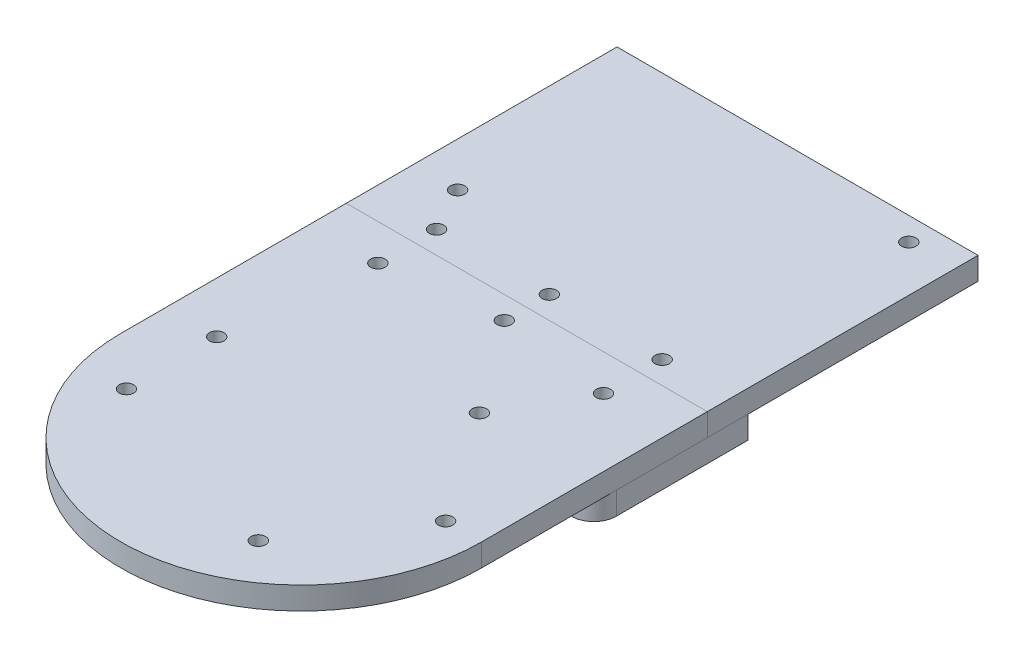
ISO-10303-21;
HEADER;
FILE_DESCRIPTION(('STEP AP214'),'2;1');
FILE_NAME('part.step','',(''),(''),'','','');
FILE_SCHEMA(('AUTOMOTIVE_DESIGN { 1 0 10303 214 1 1 1 1 }'));
ENDSEC;
DATA;
#1=APPLICATION_CONTEXT('core data for automotive mechanical design processes');
#2=APPLICATION_PROTOCOL_DEFINITION('international standard','automotive_design',2000,#1);
#3=PRODUCT_CONTEXT('',#1,'mechanical');
#4=PRODUCT('Part','Part','',(#3));
#5=PRODUCT_RELATED_PRODUCT_CATEGORY('part','',(#4));
#6=PRODUCT_DEFINITION_FORMATION('','',#4);
#7=PRODUCT_DEFINITION_CONTEXT('part definition',#1,'design');
#8=PRODUCT_DEFINITION('design','',#6,#7);
#9=PRODUCT_DEFINITION_SHAPE('','',#8);
#10=(LENGTH_UNIT() NAMED_UNIT(*) SI_UNIT(.MILLI.,.METRE.));
#11=(NAMED_UNIT(*) PLANE_ANGLE_UNIT() SI_UNIT($,.RADIAN.));
#12=(NAMED_UNIT(*) SI_UNIT($,.STERADIAN.) SOLID_ANGLE_UNIT());
#13=UNCERTAINTY_MEASURE_WITH_UNIT(LENGTH_MEASURE(1.E-05),#10,'distance_accuracy_value','');
#14=(GEOMETRIC_REPRESENTATION_CONTEXT(3) GLOBAL_UNCERTAINTY_ASSIGNED_CONTEXT((#13)) GLOBAL_UNIT_ASSIGNED_CONTEXT((#10,
#11,#12)) REPRESENTATION_CONTEXT('',''));
#15=CARTESIAN_POINT('',(0.,0.,0.));
#16=DIRECTION('',(0.,0.,1.));
#17=DIRECTION('',(1.,0.,0.));
#18=AXIS2_PLACEMENT_3D('',#15,#16,#17);
#19=CARTESIAN_POINT('',(0.,-5.,0.));
#20=DIRECTION('',(0.,1.,0.));
#21=DIRECTION('',(0.,0.,1.));
#22=AXIS2_PLACEMENT_3D('',#19,#20,#21);
#23=CYLINDRICAL_SURFACE('',#22,41.);
#24=CARTESIAN_POINT('',(0.,-5.,0.));
#25=DIRECTION('',(0.,1.,0.));
#26=DIRECTION('',(0.,0.,-1.));
#27=AXIS2_PLACEMENT_3D('',#24,#25,#26);
#28=CIRCLE('',#27,41.);
#29=CARTESIAN_POINT('',(31.195652173913,-5.,-26.605098861764));
#30=VERTEX_POINT('',#29);
#31=CARTESIAN_POINT('',(-31.195652173913,-5.,-26.605098861764));
#32=VERTEX_POINT('',#31);
#33=EDGE_CURVE('E118',#30,#32,#28,.T.);
#34=ORIENTED_EDGE('',*,*,#33,.F.);
#35=DIRECTION('',(0.,1.,0.));
#36=VECTOR('',#35,1.);
#37=CARTESIAN_POINT('',(31.195652173913,-5.,-26.605098861764));
#38=LINE('',#37,#36);
#39=CARTESIAN_POINT('',(31.195652173913,0.,-26.605098861764));
#40=VERTEX_POINT('',#39);
#41=EDGE_CURVE('E241',#30,#40,#38,.T.);
#42=ORIENTED_EDGE('',*,*,#41,.T.);
#43=CARTESIAN_POINT('',(0.,0.,0.));
#44=DIRECTION('',(0.,1.,0.));
#45=DIRECTION('',(0.,0.,-1.));
#46=AXIS2_PLACEMENT_3D('',#43,#44,#45);
#47=CIRCLE('',#46,41.);
#48=CARTESIAN_POINT('',(-31.195652173913,0.,-26.605098861764));
#49=VERTEX_POINT('',#48);
#50=EDGE_CURVE('E141',#40,#49,#47,.T.);
#51=ORIENTED_EDGE('',*,*,#50,.T.);
#52=DIRECTION('',(0.,1.,0.));
#53=VECTOR('',#52,1.);
#54=CARTESIAN_POINT('',(-31.195652173913,-5.,-26.605098861764));
#55=LINE('',#54,#53);
#56=EDGE_CURVE('E127',#49,#32,#55,.F.);
#57=ORIENTED_EDGE('',*,*,#56,.T.);
#58=EDGE_LOOP('',(#34,#42,#51,#57));
#59=FACE_BOUND('',#58,.T.);
#60=ADVANCED_FACE('F54',(#59),#23,.F.);
#61=CARTESIAN_POINT('',(-40.,-5.,-9.00000000000001));
#62=DIRECTION('',(1.,0.,0.));
#63=DIRECTION('',(0.,0.,-1.));
#64=AXIS2_PLACEMENT_3D('',#61,#62,#63);
#65=PLANE('',#64);
#66=DIRECTION('',(0.,0.,-1.));
#67=VECTOR('',#66,1.);
#68=CARTESIAN_POINT('',(-40.,-5.,-9.00000000000001));
#69=LINE('',#68,#67);
#70=CARTESIAN_POINT('',(-40.,-5.,-29.8496231131986));
#71=VERTEX_POINT('',#70);
#72=CARTESIAN_POINT('',(-40.,-5.,-59.));
#73=VERTEX_POINT('',#72);
#74=EDGE_CURVE('E109',#71,#73,#69,.T.);
#75=ORIENTED_EDGE('',*,*,#74,.F.);
#76=DIRECTION('',(0.,1.,0.));
#77=VECTOR('',#76,1.);
#78=CARTESIAN_POINT('',(-40.,-5.,-29.8496231131986));
#79=LINE('',#78,#77);
#80=CARTESIAN_POINT('',(-40.,0.,-29.8496231131986));
#81=VERTEX_POINT('',#80);
#82=EDGE_CURVE('E14',#71,#81,#79,.T.);
#83=ORIENTED_EDGE('',*,*,#82,.T.);
#84=DIRECTION('',(0.,0.,-1.));
#85=VECTOR('',#84,1.);
#86=CARTESIAN_POINT('',(-40.,0.,-9.00000000000001));
#87=LINE('',#86,#85);
#88=CARTESIAN_POINT('',(-40.,0.,-59.));
#89=VERTEX_POINT('',#88);
#90=EDGE_CURVE('E124',#81,#89,#87,.T.);
#91=ORIENTED_EDGE('',*,*,#90,.T.);
#92=DIRECTION('',(0.,1.,0.));
#93=VECTOR('',#92,1.);
#94=CARTESIAN_POINT('',(-40.,-5.,-59.));
#95=LINE('',#94,#93);
#96=EDGE_CURVE('E121',#73,#89,#95,.T.);
#97=ORIENTED_EDGE('',*,*,#96,.F.);
#98=EDGE_LOOP('',(#75,#83,#91,#97));
#99=FACE_BOUND('',#98,.T.);
#100=ADVANCED_FACE('F122',(#99),#65,.F.);
#101=CARTESIAN_POINT('',(-40.,-5.,-59.));
#102=DIRECTION('',(0.,0.,1.));
#103=DIRECTION('',(1.,0.,0.));
#104=AXIS2_PLACEMENT_3D('',#101,#102,#103);
#105=PLANE('',#104);
#106=DIRECTION('',(1.,0.,0.));
#107=VECTOR('',#106,1.);
#108=CARTESIAN_POINT('',(-40.,0.,-59.));
#109=LINE('',#108,#107);
#110=CARTESIAN_POINT('',(40.,0.,-59.));
#111=VERTEX_POINT('',#110);
#112=EDGE_CURVE('E248',#89,#111,#109,.T.);
#113=ORIENTED_EDGE('',*,*,#112,.T.);
#114=DIRECTION('',(0.,1.,0.));
#115=VECTOR('',#114,1.);
#116=CARTESIAN_POINT('',(40.,-5.,-59.));
#117=LINE('',#116,#115);
#118=CARTESIAN_POINT('',(40.,-5.,-59.));
#119=VERTEX_POINT('',#118);
#120=EDGE_CURVE('E128',#119,#111,#117,.T.);
#121=ORIENTED_EDGE('',*,*,#120,.F.);
#122=DIRECTION('',(1.,0.,0.));
#123=VECTOR('',#122,1.);
#124=CARTESIAN_POINT('',(-40.,-5.,-59.));
#125=LINE('',#124,#123);
#126=EDGE_CURVE('E113',#73,#119,#125,.T.);
#127=ORIENTED_EDGE('',*,*,#126,.F.);
#128=ORIENTED_EDGE('',*,*,#96,.T.);
#129=EDGE_LOOP('',(#113,#121,#127,#128));
#130=FACE_BOUND('',#129,.T.);
#131=ADVANCED_FACE('F130',(#130),#105,.F.);
#132=CARTESIAN_POINT('',(40.,-5.,-9.00000000000001));
#133=DIRECTION('',(-1.,0.,0.));
#134=DIRECTION('',(0.,0.,1.));
#135=AXIS2_PLACEMENT_3D('',#132,#133,#134);
#136=PLANE('',#135);
#137=DIRECTION('',(0.,0.,1.));
#138=VECTOR('',#137,1.);
#139=CARTESIAN_POINT('',(40.,0.,-9.00000000000001));
#140=LINE('',#139,#138);
#141=CARTESIAN_POINT('',(40.,0.,-29.8496231131986));
#142=VERTEX_POINT('',#141);
#143=EDGE_CURVE('E246',#111,#142,#140,.T.);
#144=ORIENTED_EDGE('',*,*,#143,.T.);
#145=DIRECTION('',(0.,1.,0.));
#146=VECTOR('',#145,1.);
#147=CARTESIAN_POINT('',(40.,-5.,-29.8496231131986));
#148=LINE('',#147,#146);
#149=CARTESIAN_POINT('',(40.,-5.,-29.8496231131986));
#150=VERTEX_POINT('',#149);
#151=EDGE_CURVE('E79',#142,#150,#148,.F.);
#152=ORIENTED_EDGE('',*,*,#151,.T.);
#153=DIRECTION('',(0.,0.,1.));
#154=VECTOR('',#153,1.);
#155=CARTESIAN_POINT('',(40.,-5.,-9.00000000000001));
#156=LINE('',#155,#154);
#157=EDGE_CURVE('E133',#119,#150,#156,.T.);
#158=ORIENTED_EDGE('',*,*,#157,.F.);
#159=ORIENTED_EDGE('',*,*,#120,.T.);
#160=EDGE_LOOP('',(#144,#152,#158,#159));
#161=FACE_BOUND('',#160,.T.);
#162=ADVANCED_FACE('F209',(#161),#136,.F.);
#163=CARTESIAN_POINT('',(0.,-5.,0.));
#164=DIRECTION('',(0.,-1.,0.));
#165=DIRECTION('',(0.,0.,-1.));
#166=AXIS2_PLACEMENT_3D('',#163,#164,#165);
#167=PLANE('',#166);
#168=CARTESIAN_POINT('',(-25.,-5.,-42.));
#169=DIRECTION('',(0.,-1.,0.));
#170=DIRECTION('',(0.,0.,-1.));
#171=AXIS2_PLACEMENT_3D('',#168,#169,#170);
#172=CIRCLE('',#171,1.6);
#173=CARTESIAN_POINT('',(-25.,-5.,-43.6));
#174=VERTEX_POINT('',#173);
#175=EDGE_CURVE('E251',#174,#174,#172,.T.);
#176=ORIENTED_EDGE('',*,*,#175,.F.);
#177=EDGE_LOOP('',(#176));
#178=FACE_BOUND('',#177,.T.);
#179=CARTESIAN_POINT('',(0.,-5.,-55.));
#180=DIRECTION('',(0.,-1.,0.));
#181=DIRECTION('',(0.,0.,-1.));
#182=AXIS2_PLACEMENT_3D('',#179,#180,#181);
#183=CIRCLE('',#182,1.6);
#184=CARTESIAN_POINT('',(0.,-5.,-56.6));
#185=VERTEX_POINT('',#184);
#186=EDGE_CURVE('E174',#185,#185,#183,.T.);
#187=ORIENTED_EDGE('',*,*,#186,.F.);
#188=EDGE_LOOP('',(#187));
#189=FACE_BOUND('',#188,.T.);
#190=CARTESIAN_POINT('',(0.,-5.,-45.));
#191=DIRECTION('',(0.,-1.,0.));
#192=DIRECTION('',(0.,0.,-1.));
#193=AXIS2_PLACEMENT_3D('',#190,#191,#192);
#194=CIRCLE('',#193,1.6);
#195=CARTESIAN_POINT('',(0.,-5.,-46.6));
#196=VERTEX_POINT('',#195);
#197=EDGE_CURVE('E171',#196,#196,#194,.T.);
#198=ORIENTED_EDGE('',*,*,#197,.F.);
#199=EDGE_LOOP('',(#198));
#200=FACE_BOUND('',#199,.T.);
#201=CARTESIAN_POINT('',(25.,-5.,-55.));
#202=DIRECTION('',(0.,-1.,0.));
#203=DIRECTION('',(0.,0.,-1.));
#204=AXIS2_PLACEMENT_3D('',#201,#202,#203);
#205=CIRCLE('',#204,1.60000000000001);
#206=CARTESIAN_POINT('',(25.,-5.,-56.6));
#207=VERTEX_POINT('',#206);
#208=EDGE_CURVE('E168',#207,#207,#205,.T.);
#209=ORIENTED_EDGE('',*,*,#208,.F.);
#210=EDGE_LOOP('',(#209));
#211=FACE_BOUND('',#210,.T.);
#212=CARTESIAN_POINT('',(-25.,-5.,-55.));
#213=DIRECTION('',(0.,-1.,0.));
#214=DIRECTION('',(0.,0.,-1.));
#215=AXIS2_PLACEMENT_3D('',#212,#213,#214);
#216=CIRCLE('',#215,1.6);
#217=CARTESIAN_POINT('',(-25.,-5.,-56.6));
#218=VERTEX_POINT('',#217);
#219=EDGE_CURVE('E164',#218,#218,#216,.T.);
#220=ORIENTED_EDGE('',*,*,#219,.F.);
#221=EDGE_LOOP('',(#220));
#222=FACE_BOUND('',#221,.T.);
#223=CARTESIAN_POINT('',(25.,-5.,-42.));
#224=DIRECTION('',(0.,-1.,0.));
#225=DIRECTION('',(0.,0.,-1.));
#226=AXIS2_PLACEMENT_3D('',#223,#224,#225);
#227=CIRCLE('',#226,1.60000000000001);
#228=CARTESIAN_POINT('',(25.,-5.,-43.6));
#229=VERTEX_POINT('',#228);
#230=EDGE_CURVE('E160',#229,#229,#227,.T.);
#231=ORIENTED_EDGE('',*,*,#230,.F.);
#232=EDGE_LOOP('',(#231));
#233=FACE_BOUND('',#232,.T.);
#234=ORIENTED_EDGE('',*,*,#157,.T.);
#235=CARTESIAN_POINT('',(35.,-5.,-29.8496231131986));
#236=DIRECTION('',(0.,-1.,0.));
#237=DIRECTION('',(0.,0.,-1.));
#238=AXIS2_PLACEMENT_3D('',#235,#236,#237);
#239=CIRCLE('',#238,5.);
#240=EDGE_CURVE('E63',#150,#30,#239,.T.);
#241=ORIENTED_EDGE('',*,*,#240,.T.);
#242=ORIENTED_EDGE('',*,*,#33,.T.);
#243=CARTESIAN_POINT('',(-35.,-5.,-29.8496231131986));
#244=DIRECTION('',(0.,-1.,0.));
#245=DIRECTION('',(0.,0.,-1.));
#246=AXIS2_PLACEMENT_3D('',#243,#244,#245);
#247=CIRCLE('',#246,5.);
#248=EDGE_CURVE('E71',#32,#71,#247,.T.);
#249=ORIENTED_EDGE('',*,*,#248,.T.);
#250=ORIENTED_EDGE('',*,*,#74,.T.);
#251=ORIENTED_EDGE('',*,*,#126,.T.);
#252=EDGE_LOOP('',(#234,#241,#242,#249,#250,#251));
#253=FACE_BOUND('',#252,.T.);
#254=ADVANCED_FACE('F111',(#178,#189,#200,#211,#222,#233,#253),#167,.T.);
#255=CARTESIAN_POINT('',(0.,0.,0.));
#256=DIRECTION('',(0.,-1.,0.));
#257=DIRECTION('',(0.,0.,-1.));
#258=AXIS2_PLACEMENT_3D('',#255,#256,#257);
#259=PLANE('',#258);
#260=CARTESIAN_POINT('',(-25.,0.,-42.));
#261=DIRECTION('',(0.,-1.,0.));
#262=DIRECTION('',(0.,0.,-1.));
#263=AXIS2_PLACEMENT_3D('',#260,#261,#262);
#264=CIRCLE('',#263,1.6);
#265=CARTESIAN_POINT('',(-25.,0.,-43.6));
#266=VERTEX_POINT('',#265);
#267=EDGE_CURVE('E58',#266,#266,#264,.T.);
#268=ORIENTED_EDGE('',*,*,#267,.T.);
#269=EDGE_LOOP('',(#268));
#270=FACE_BOUND('',#269,.T.);
#271=CARTESIAN_POINT('',(0.,0.,-55.));
#272=DIRECTION('',(0.,-1.,0.));
#273=DIRECTION('',(0.,0.,-1.));
#274=AXIS2_PLACEMENT_3D('',#271,#272,#273);
#275=CIRCLE('',#274,1.6);
#276=CARTESIAN_POINT('',(0.,0.,-56.6));
#277=VERTEX_POINT('',#276);
#278=EDGE_CURVE('E172',#277,#277,#275,.T.);
#279=ORIENTED_EDGE('',*,*,#278,.T.);
#280=EDGE_LOOP('',(#279));
#281=FACE_BOUND('',#280,.T.);
#282=CARTESIAN_POINT('',(0.,0.,-45.));
#283=DIRECTION('',(0.,-1.,0.));
#284=DIRECTION('',(0.,0.,-1.));
#285=AXIS2_PLACEMENT_3D('',#282,#283,#284);
#286=CIRCLE('',#285,1.6);
#287=CARTESIAN_POINT('',(0.,0.,-46.6));
#288=VERTEX_POINT('',#287);
#289=EDGE_CURVE('E169',#288,#288,#286,.T.);
#290=ORIENTED_EDGE('',*,*,#289,.T.);
#291=EDGE_LOOP('',(#290));
#292=FACE_BOUND('',#291,.T.);
#293=CARTESIAN_POINT('',(25.,0.,-55.));
#294=DIRECTION('',(0.,-1.,0.));
#295=DIRECTION('',(0.,0.,-1.));
#296=AXIS2_PLACEMENT_3D('',#293,#294,#295);
#297=CIRCLE('',#296,1.60000000000001);
#298=CARTESIAN_POINT('',(25.,0.,-56.6));
#299=VERTEX_POINT('',#298);
#300=EDGE_CURVE('E165',#299,#299,#297,.T.);
#301=ORIENTED_EDGE('',*,*,#300,.T.);
#302=EDGE_LOOP('',(#301));
#303=FACE_BOUND('',#302,.T.);
#304=CARTESIAN_POINT('',(-25.,0.,-55.));
#305=DIRECTION('',(0.,-1.,0.));
#306=DIRECTION('',(0.,0.,-1.));
#307=AXIS2_PLACEMENT_3D('',#304,#305,#306);
#308=CIRCLE('',#307,1.6);
#309=CARTESIAN_POINT('',(-25.,0.,-56.6));
#310=VERTEX_POINT('',#309);
#311=EDGE_CURVE('E161',#310,#310,#308,.T.);
#312=ORIENTED_EDGE('',*,*,#311,.T.);
#313=EDGE_LOOP('',(#312));
#314=FACE_BOUND('',#313,.T.);
#315=CARTESIAN_POINT('',(25.,0.,-42.));
#316=DIRECTION('',(0.,-1.,0.));
#317=DIRECTION('',(0.,0.,-1.));
#318=AXIS2_PLACEMENT_3D('',#315,#316,#317);
#319=CIRCLE('',#318,1.60000000000001);
#320=CARTESIAN_POINT('',(25.,0.,-43.6));
#321=VERTEX_POINT('',#320);
#322=EDGE_CURVE('E157',#321,#321,#319,.T.);
#323=ORIENTED_EDGE('',*,*,#322,.T.);
#324=EDGE_LOOP('',(#323));
#325=FACE_BOUND('',#324,.T.);
#326=ORIENTED_EDGE('',*,*,#50,.F.);
#327=CARTESIAN_POINT('',(35.,0.,-29.8496231131986));
#328=DIRECTION('',(0.,-1.,0.));
#329=DIRECTION('',(0.,0.,-1.));
#330=AXIS2_PLACEMENT_3D('',#327,#328,#329);
#331=CIRCLE('',#330,5.);
#332=EDGE_CURVE('E292',#40,#142,#331,.F.);
#333=ORIENTED_EDGE('',*,*,#332,.T.);
#334=ORIENTED_EDGE('',*,*,#143,.F.);
#335=ORIENTED_EDGE('',*,*,#112,.F.);
#336=ORIENTED_EDGE('',*,*,#90,.F.);
#337=CARTESIAN_POINT('',(-35.,0.,-29.8496231131986));
#338=DIRECTION('',(0.,-1.,0.));
#339=DIRECTION('',(0.,0.,-1.));
#340=AXIS2_PLACEMENT_3D('',#337,#338,#339);
#341=CIRCLE('',#340,5.);
#342=EDGE_CURVE('E293',#81,#49,#341,.F.);
#343=ORIENTED_EDGE('',*,*,#342,.T.);
#344=EDGE_LOOP('',(#326,#333,#334,#335,#336,#343));
#345=FACE_BOUND('',#344,.T.);
#346=ADVANCED_FACE('F208',(#270,#281,#292,#303,#314,#325,#345),#259,.F.);
#347=CARTESIAN_POINT('',(35.,-5.,-29.8496231131986));
#348=DIRECTION('',(0.,1.,0.));
#349=DIRECTION('',(0.,0.,1.));
#350=AXIS2_PLACEMENT_3D('',#347,#348,#349);
#351=CYLINDRICAL_SURFACE('',#350,5.);
#352=ORIENTED_EDGE('',*,*,#240,.F.);
#353=ORIENTED_EDGE('',*,*,#151,.F.);
#354=ORIENTED_EDGE('',*,*,#332,.F.);
#355=ORIENTED_EDGE('',*,*,#41,.F.);
#356=EDGE_LOOP('',(#352,#353,#354,#355));
#357=FACE_BOUND('',#356,.T.);
#358=ADVANCED_FACE('F216',(#357),#351,.T.);
#359=CARTESIAN_POINT('',(-35.,-5.,-29.8496231131986));
#360=DIRECTION('',(0.,1.,0.));
#361=DIRECTION('',(0.,0.,1.));
#362=AXIS2_PLACEMENT_3D('',#359,#360,#361);
#363=CYLINDRICAL_SURFACE('',#362,5.);
#364=ORIENTED_EDGE('',*,*,#248,.F.);
#365=ORIENTED_EDGE('',*,*,#56,.F.);
#366=ORIENTED_EDGE('',*,*,#342,.F.);
#367=ORIENTED_EDGE('',*,*,#82,.F.);
#368=EDGE_LOOP('',(#364,#365,#366,#367));
#369=FACE_BOUND('',#368,.T.);
#370=ADVANCED_FACE('F56',(#369),#363,.T.);
#371=CARTESIAN_POINT('',(25.,-34.,-42.));
#372=DIRECTION('',(0.,1.,0.));
#373=DIRECTION('',(0.,0.,1.));
#374=AXIS2_PLACEMENT_3D('',#371,#372,#373);
#375=CYLINDRICAL_SURFACE('',#374,1.60000000000001);
#376=ORIENTED_EDGE('',*,*,#230,.T.);
#377=EDGE_LOOP('',(#376));
#378=FACE_BOUND('',#377,.T.);
#379=ORIENTED_EDGE('',*,*,#322,.F.);
#380=EDGE_LOOP('',(#379));
#381=FACE_BOUND('',#380,.T.);
#382=ADVANCED_FACE('F204',(#378,#381),#375,.F.);
#383=CARTESIAN_POINT('',(-25.,-34.,-55.));
#384=DIRECTION('',(0.,1.,0.));
#385=DIRECTION('',(0.,0.,1.));
#386=AXIS2_PLACEMENT_3D('',#383,#384,#385);
#387=CYLINDRICAL_SURFACE('',#386,1.6);
#388=ORIENTED_EDGE('',*,*,#219,.T.);
#389=EDGE_LOOP('',(#388));
#390=FACE_BOUND('',#389,.T.);
#391=ORIENTED_EDGE('',*,*,#311,.F.);
#392=EDGE_LOOP('',(#391));
#393=FACE_BOUND('',#392,.T.);
#394=ADVANCED_FACE('F274',(#390,#393),#387,.F.);
#395=CARTESIAN_POINT('',(25.,-34.,-55.));
#396=DIRECTION('',(0.,1.,0.));
#397=DIRECTION('',(0.,0.,1.));
#398=AXIS2_PLACEMENT_3D('',#395,#396,#397);
#399=CYLINDRICAL_SURFACE('',#398,1.60000000000001);
#400=ORIENTED_EDGE('',*,*,#208,.T.);
#401=EDGE_LOOP('',(#400));
#402=FACE_BOUND('',#401,.T.);
#403=ORIENTED_EDGE('',*,*,#300,.F.);
#404=EDGE_LOOP('',(#403));
#405=FACE_BOUND('',#404,.T.);
#406=ADVANCED_FACE('F271',(#402,#405),#399,.F.);
#407=CARTESIAN_POINT('',(0.,-34.,-45.));
#408=DIRECTION('',(0.,1.,0.));
#409=DIRECTION('',(0.,0.,1.));
#410=AXIS2_PLACEMENT_3D('',#407,#408,#409);
#411=CYLINDRICAL_SURFACE('',#410,1.6);
#412=ORIENTED_EDGE('',*,*,#197,.T.);
#413=EDGE_LOOP('',(#412));
#414=FACE_BOUND('',#413,.T.);
#415=ORIENTED_EDGE('',*,*,#289,.F.);
#416=EDGE_LOOP('',(#415));
#417=FACE_BOUND('',#416,.T.);
#418=ADVANCED_FACE('F266',(#414,#417),#411,.F.);
#419=CARTESIAN_POINT('',(0.,-34.,-55.));
#420=DIRECTION('',(0.,1.,0.));
#421=DIRECTION('',(0.,0.,1.));
#422=AXIS2_PLACEMENT_3D('',#419,#420,#421);
#423=CYLINDRICAL_SURFACE('',#422,1.6);
#424=ORIENTED_EDGE('',*,*,#186,.T.);
#425=EDGE_LOOP('',(#424));
#426=FACE_BOUND('',#425,.T.);
#427=ORIENTED_EDGE('',*,*,#278,.F.);
#428=EDGE_LOOP('',(#427));
#429=FACE_BOUND('',#428,.T.);
#430=ADVANCED_FACE('F261',(#426,#429),#423,.F.);
#431=CARTESIAN_POINT('',(-25.,-34.,-42.));
#432=DIRECTION('',(0.,1.,0.));
#433=DIRECTION('',(0.,0.,1.));
#434=AXIS2_PLACEMENT_3D('',#431,#432,#433);
#435=CYLINDRICAL_SURFACE('',#434,1.6);
#436=ORIENTED_EDGE('',*,*,#175,.T.);
#437=EDGE_LOOP('',(#436));
#438=FACE_BOUND('',#437,.T.);
#439=ORIENTED_EDGE('',*,*,#267,.F.);
#440=EDGE_LOOP('',(#439));
#441=FACE_BOUND('',#440,.T.);
#442=ADVANCED_FACE('F259',(#438,#441),#435,.F.);
#443=CLOSED_SHELL('',(#60,#100,#131,#162,#254,#346,#358,#370,#382,#394,#406,#418,#430,#442));
#444=MANIFOLD_SOLID_BREP('B2',#443);
#445=CARTESIAN_POINT('',(0.,0.,-50.));
#446=DIRECTION('',(0.,0.,-1.));
#447=DIRECTION('',(-1.,0.,0.));
#448=AXIS2_PLACEMENT_3D('',#445,#446,#447);
#449=PLANE('',#448);
#450=DIRECTION('',(-1.,0.,0.));
#451=VECTOR('',#450,1.);
#452=CARTESIAN_POINT('',(0.,5.,-50.));
#453=LINE('',#452,#451);
#454=CARTESIAN_POINT('',(40.,5.,-50.));
#455=VERTEX_POINT('',#454);
#456=CARTESIAN_POINT('',(-40.,5.,-50.));
#457=VERTEX_POINT('',#456);
#458=EDGE_CURVE('E441',#455,#457,#453,.T.);
#459=ORIENTED_EDGE('',*,*,#458,.F.);
#460=DIRECTION('',(0.,-1.,0.));
#461=VECTOR('',#460,1.);
#462=CARTESIAN_POINT('',(40.,5.,-50.));
#463=LINE('',#462,#461);
#464=CARTESIAN_POINT('',(40.,0.,-50.));
#465=VERTEX_POINT('',#464);
#466=EDGE_CURVE('E462',#455,#465,#463,.T.);
#467=ORIENTED_EDGE('',*,*,#466,.T.);
#468=DIRECTION('',(-1.,0.,0.));
#469=VECTOR('',#468,1.);
#470=CARTESIAN_POINT('',(0.,0.,-50.));
#471=LINE('',#470,#469);
#472=CARTESIAN_POINT('',(-40.,0.,-50.));
#473=VERTEX_POINT('',#472);
#474=EDGE_CURVE('E453',#465,#473,#471,.T.);
#475=ORIENTED_EDGE('',*,*,#474,.T.);
#476=DIRECTION('',(0.,1.,0.));
#477=VECTOR('',#476,1.);
#478=CARTESIAN_POINT('',(-40.,5.,-50.));
#479=LINE('',#478,#477);
#480=EDGE_CURVE('E460',#473,#457,#479,.T.);
#481=ORIENTED_EDGE('',*,*,#480,.T.);
#482=EDGE_LOOP('',(#459,#467,#475,#481));
#483=FACE_BOUND('',#482,.T.);
#484=ADVANCED_FACE('F400',(#483),#449,.T.);
#485=CARTESIAN_POINT('',(40.,5.,0.));
#486=DIRECTION('',(-1.,0.,0.));
#487=DIRECTION('',(0.,0.,1.));
#488=AXIS2_PLACEMENT_3D('',#485,#486,#487);
#489=PLANE('',#488);
#490=ORIENTED_EDGE('',*,*,#466,.F.);
#491=DIRECTION('',(0.,0.,-1.));
#492=VECTOR('',#491,1.);
#493=CARTESIAN_POINT('',(40.,5.,0.));
#494=LINE('',#493,#492);
#495=CARTESIAN_POINT('',(40.,5.,0.));
#496=VERTEX_POINT('',#495);
#497=EDGE_CURVE('E515',#496,#455,#494,.T.);
#498=ORIENTED_EDGE('',*,*,#497,.F.);
#499=DIRECTION('',(0.,-1.,0.));
#500=VECTOR('',#499,1.);
#501=CARTESIAN_POINT('',(40.,5.,0.));
#502=LINE('',#501,#500);
#503=CARTESIAN_POINT('',(40.,0.,0.));
#504=VERTEX_POINT('',#503);
#505=EDGE_CURVE('E508',#496,#504,#502,.T.);
#506=ORIENTED_EDGE('',*,*,#505,.T.);
#507=DIRECTION('',(0.,0.,-1.));
#508=VECTOR('',#507,1.);
#509=CARTESIAN_POINT('',(40.,0.,0.));
#510=LINE('',#509,#508);
#511=EDGE_CURVE('E421',#504,#465,#510,.T.);
#512=ORIENTED_EDGE('',*,*,#511,.T.);
#513=EDGE_LOOP('',(#490,#498,#506,#512));
#514=FACE_BOUND('',#513,.T.);
#515=ADVANCED_FACE('F542',(#514),#489,.F.);
#516=CARTESIAN_POINT('',(-40.,5.,0.));
#517=DIRECTION('',(1.,0.,0.));
#518=DIRECTION('',(0.,0.,-1.));
#519=AXIS2_PLACEMENT_3D('',#516,#517,#518);
#520=PLANE('',#519);
#521=ORIENTED_EDGE('',*,*,#480,.F.);
#522=DIRECTION('',(0.,0.,1.));
#523=VECTOR('',#522,1.);
#524=CARTESIAN_POINT('',(-40.,0.,0.));
#525=LINE('',#524,#523);
#526=CARTESIAN_POINT('',(-40.,0.,0.));
#527=VERTEX_POINT('',#526);
#528=EDGE_CURVE('E449',#473,#527,#525,.T.);
#529=ORIENTED_EDGE('',*,*,#528,.T.);
#530=DIRECTION('',(0.,-1.,0.));
#531=VECTOR('',#530,1.);
#532=CARTESIAN_POINT('',(-40.,5.,0.));
#533=LINE('',#532,#531);
#534=CARTESIAN_POINT('',(-40.,5.,0.));
#535=VERTEX_POINT('',#534);
#536=EDGE_CURVE('E510',#535,#527,#533,.T.);
#537=ORIENTED_EDGE('',*,*,#536,.F.);
#538=DIRECTION('',(0.,0.,1.));
#539=VECTOR('',#538,1.);
#540=CARTESIAN_POINT('',(-40.,5.,0.));
#541=LINE('',#540,#539);
#542=EDGE_CURVE('E433',#457,#535,#541,.T.);
#543=ORIENTED_EDGE('',*,*,#542,.F.);
#544=EDGE_LOOP('',(#521,#529,#537,#543));
#545=FACE_BOUND('',#544,.T.);
#546=ADVANCED_FACE('F461',(#545),#520,.F.);
#547=CARTESIAN_POINT('',(0.,5.,0.));
#548=DIRECTION('',(0.,1.,0.));
#549=DIRECTION('',(0.,0.,1.));
#550=AXIS2_PLACEMENT_3D('',#547,#548,#549);
#551=PLANE('',#550);
#552=CARTESIAN_POINT('',(0.,5.,-45.));
#553=DIRECTION('',(0.,-1.,0.));
#554=DIRECTION('',(0.,0.,-1.));
#555=AXIS2_PLACEMENT_3D('',#552,#553,#554);
#556=CIRCLE('',#555,1.6);
#557=CARTESIAN_POINT('',(0.,5.,-46.6));
#558=VERTEX_POINT('',#557);
#559=EDGE_CURVE('E489',#558,#558,#556,.T.);
#560=ORIENTED_EDGE('',*,*,#559,.T.);
#561=EDGE_LOOP('',(#560));
#562=FACE_BOUND('',#561,.T.);
#563=CARTESIAN_POINT('',(-25.,5.,-42.));
#564=DIRECTION('',(0.,-1.,0.));
#565=DIRECTION('',(0.,0.,-1.));
#566=AXIS2_PLACEMENT_3D('',#563,#564,#565);
#567=CIRCLE('',#566,1.6);
#568=CARTESIAN_POINT('',(-25.,5.,-43.6));
#569=VERTEX_POINT('',#568);
#570=EDGE_CURVE('E609',#569,#569,#567,.T.);
#571=ORIENTED_EDGE('',*,*,#570,.T.);
#572=EDGE_LOOP('',(#571));
#573=FACE_BOUND('',#572,.T.);
#574=CARTESIAN_POINT('',(25.,5.,-42.));
#575=DIRECTION('',(0.,-1.,0.));
#576=DIRECTION('',(0.,0.,1.));
#577=AXIS2_PLACEMENT_3D('',#574,#575,#576);
#578=CIRCLE('',#577,1.6);
#579=CARTESIAN_POINT('',(25.,5.,-40.4));
#580=VERTEX_POINT('',#579);
#581=EDGE_CURVE('E611',#580,#580,#578,.T.);
#582=ORIENTED_EDGE('',*,*,#581,.T.);
#583=EDGE_LOOP('',(#582));
#584=FACE_BOUND('',#583,.T.);
#585=CARTESIAN_POINT('',(15.,5.,24.5000000000001));
#586=DIRECTION('',(0.,1.,0.));
#587=DIRECTION('',(0.,0.,1.));
#588=AXIS2_PLACEMENT_3D('',#585,#586,#587);
#589=CIRCLE('',#588,1.6);
#590=CARTESIAN_POINT('',(15.,5.,26.1000000000001));
#591=VERTEX_POINT('',#590);
#592=EDGE_CURVE('E516',#591,#591,#589,.T.);
#593=ORIENTED_EDGE('',*,*,#592,.F.);
#594=EDGE_LOOP('',(#593));
#595=FACE_BOUND('',#594,.T.);
#596=CARTESIAN_POINT('',(15.,5.,-24.4999999999999));
#597=DIRECTION('',(0.,1.,0.));
#598=DIRECTION('',(0.,0.,1.));
#599=AXIS2_PLACEMENT_3D('',#596,#597,#598);
#600=CIRCLE('',#599,1.6);
#601=CARTESIAN_POINT('',(15.,5.,-22.8999999999999));
#602=VERTEX_POINT('',#601);
#603=EDGE_CURVE('E504',#602,#602,#600,.T.);
#604=ORIENTED_EDGE('',*,*,#603,.F.);
#605=EDGE_LOOP('',(#604));
#606=FACE_BOUND('',#605,.T.);
#607=CARTESIAN_POINT('',(-28.7249999999953,5.,9.99999999999992));
#608=DIRECTION('',(0.,1.,0.));
#609=DIRECTION('',(0.,0.,1.));
#610=AXIS2_PLACEMENT_3D('',#607,#608,#609);
#611=CIRCLE('',#610,1.6);
#612=CARTESIAN_POINT('',(-28.7249999999953,5.,11.5999999999999));
#613=VERTEX_POINT('',#612);
#614=EDGE_CURVE('E527',#613,#613,#611,.T.);
#615=ORIENTED_EDGE('',*,*,#614,.F.);
#616=EDGE_LOOP('',(#615));
#617=FACE_BOUND('',#616,.T.);
#618=CARTESIAN_POINT('',(-28.7249999999953,5.,-10.0000000000001));
#619=DIRECTION('',(0.,1.,0.));
#620=DIRECTION('',(0.,0.,1.));
#621=AXIS2_PLACEMENT_3D('',#618,#619,#620);
#622=CIRCLE('',#621,1.6);
#623=CARTESIAN_POINT('',(-28.7249999999953,5.,-8.40000000000007));
#624=VERTEX_POINT('',#623);
#625=EDGE_CURVE('E524',#624,#624,#622,.T.);
#626=ORIENTED_EDGE('',*,*,#625,.F.);
#627=EDGE_LOOP('',(#626));
#628=FACE_BOUND('',#627,.T.);
#629=CARTESIAN_POINT('',(32.,5.,0.));
#630=DIRECTION('',(0.,1.,0.));
#631=DIRECTION('',(0.,0.,1.));
#632=AXIS2_PLACEMENT_3D('',#629,#630,#631);
#633=CIRCLE('',#632,1.6);
#634=CARTESIAN_POINT('',(32.,5.,1.6));
#635=VERTEX_POINT('',#634);
#636=EDGE_CURVE('E519',#635,#635,#633,.T.);
#637=ORIENTED_EDGE('',*,*,#636,.F.);
#638=EDGE_LOOP('',(#637));
#639=FACE_BOUND('',#638,.T.);
#640=ORIENTED_EDGE('',*,*,#497,.T.);
#641=ORIENTED_EDGE('',*,*,#458,.T.);
#642=ORIENTED_EDGE('',*,*,#542,.T.);
#643=CARTESIAN_POINT('',(0.,5.,0.));
#644=DIRECTION('',(0.,1.,0.));
#645=DIRECTION('',(0.,0.,1.));
#646=AXIS2_PLACEMENT_3D('',#643,#644,#645);
#647=CIRCLE('',#646,40.);
#648=EDGE_CURVE('E459',#535,#496,#647,.T.);
#649=ORIENTED_EDGE('',*,*,#648,.T.);
#650=EDGE_LOOP('',(#640,#641,#642,#649));
#651=FACE_BOUND('',#650,.T.);
#652=ADVANCED_FACE('F402',(#562,#573,#584,#595,#606,#617,#628,#639,#651),#551,.T.);
#653=CARTESIAN_POINT('',(0.,0.,0.));
#654=DIRECTION('',(0.,1.,0.));
#655=DIRECTION('',(0.,0.,1.));
#656=AXIS2_PLACEMENT_3D('',#653,#654,#655);
#657=PLANE('',#656);
#658=CARTESIAN_POINT('',(0.,0.,-45.));
#659=DIRECTION('',(0.,1.,0.));
#660=DIRECTION('',(0.,0.,1.));
#661=AXIS2_PLACEMENT_3D('',#658,#659,#660);
#662=CIRCLE('',#661,1.6);
#663=CARTESIAN_POINT('',(0.,0.,-43.4));
#664=VERTEX_POINT('',#663);
#665=EDGE_CURVE('E404',#664,#664,#662,.T.);
#666=ORIENTED_EDGE('',*,*,#665,.T.);
#667=EDGE_LOOP('',(#666));
#668=FACE_BOUND('',#667,.T.);
#669=CARTESIAN_POINT('',(-25.,0.,-42.));
#670=DIRECTION('',(0.,1.,0.));
#671=DIRECTION('',(0.,0.,1.));
#672=AXIS2_PLACEMENT_3D('',#669,#670,#671);
#673=CIRCLE('',#672,1.6);
#674=CARTESIAN_POINT('',(-25.,0.,-40.4));
#675=VERTEX_POINT('',#674);
#676=EDGE_CURVE('E470',#675,#675,#673,.T.);
#677=ORIENTED_EDGE('',*,*,#676,.T.);
#678=EDGE_LOOP('',(#677));
#679=FACE_BOUND('',#678,.T.);
#680=CARTESIAN_POINT('',(25.,0.,-42.));
#681=DIRECTION('',(0.,1.,0.));
#682=DIRECTION('',(0.,0.,1.));
#683=AXIS2_PLACEMENT_3D('',#680,#681,#682);
#684=CIRCLE('',#683,1.6);
#685=CARTESIAN_POINT('',(25.,0.,-40.4));
#686=VERTEX_POINT('',#685);
#687=EDGE_CURVE('E485',#686,#686,#684,.T.);
#688=ORIENTED_EDGE('',*,*,#687,.T.);
#689=EDGE_LOOP('',(#688));
#690=FACE_BOUND('',#689,.T.);
#691=CARTESIAN_POINT('',(15.,0.,24.5000000000001));
#692=DIRECTION('',(0.,1.,0.));
#693=DIRECTION('',(0.,0.,1.));
#694=AXIS2_PLACEMENT_3D('',#691,#692,#693);
#695=CIRCLE('',#694,1.6);
#696=CARTESIAN_POINT('',(15.,0.,26.1000000000001));
#697=VERTEX_POINT('',#696);
#698=EDGE_CURVE('E499',#697,#697,#695,.T.);
#699=ORIENTED_EDGE('',*,*,#698,.T.);
#700=EDGE_LOOP('',(#699));
#701=FACE_BOUND('',#700,.T.);
#702=CARTESIAN_POINT('',(15.,0.,-24.4999999999999));
#703=DIRECTION('',(0.,1.,0.));
#704=DIRECTION('',(0.,0.,1.));
#705=AXIS2_PLACEMENT_3D('',#702,#703,#704);
#706=CIRCLE('',#705,1.6);
#707=CARTESIAN_POINT('',(15.,0.,-22.8999999999999));
#708=VERTEX_POINT('',#707);
#709=EDGE_CURVE('E505',#708,#708,#706,.T.);
#710=ORIENTED_EDGE('',*,*,#709,.T.);
#711=EDGE_LOOP('',(#710));
#712=FACE_BOUND('',#711,.T.);
#713=CARTESIAN_POINT('',(-28.7249999999953,0.,9.99999999999992));
#714=DIRECTION('',(0.,-1.,0.));
#715=DIRECTION('',(0.,0.,-1.));
#716=AXIS2_PLACEMENT_3D('',#713,#714,#715);
#717=CIRCLE('',#716,1.6);
#718=CARTESIAN_POINT('',(-28.7249999999953,0.,8.39999999999992));
#719=VERTEX_POINT('',#718);
#720=EDGE_CURVE('E52',#719,#719,#717,.T.);
#721=ORIENTED_EDGE('',*,*,#720,.F.);
#722=EDGE_LOOP('',(#721));
#723=FACE_BOUND('',#722,.T.);
#724=CARTESIAN_POINT('',(-28.7249999999953,0.,-10.0000000000001));
#725=DIRECTION('',(0.,-1.,0.));
#726=DIRECTION('',(0.,0.,-1.));
#727=AXIS2_PLACEMENT_3D('',#724,#725,#726);
#728=CIRCLE('',#727,1.6);
#729=CARTESIAN_POINT('',(-28.7249999999953,0.,-11.6000000000001));
#730=VERTEX_POINT('',#729);
#731=EDGE_CURVE('E412',#730,#730,#728,.T.);
#732=ORIENTED_EDGE('',*,*,#731,.F.);
#733=EDGE_LOOP('',(#732));
#734=FACE_BOUND('',#733,.T.);
#735=CARTESIAN_POINT('',(32.,0.,0.));
#736=DIRECTION('',(0.,-1.,0.));
#737=DIRECTION('',(0.,0.,-1.));
#738=AXIS2_PLACEMENT_3D('',#735,#736,#737);
#739=CIRCLE('',#738,1.6);
#740=CARTESIAN_POINT('',(32.,0.,-1.6));
#741=VERTEX_POINT('',#740);
#742=EDGE_CURVE('E529',#741,#741,#739,.T.);
#743=ORIENTED_EDGE('',*,*,#742,.F.);
#744=EDGE_LOOP('',(#743));
#745=FACE_BOUND('',#744,.T.);
#746=ORIENTED_EDGE('',*,*,#474,.F.);
#747=ORIENTED_EDGE('',*,*,#511,.F.);
#748=CARTESIAN_POINT('',(0.,0.,0.));
#749=DIRECTION('',(0.,1.,0.));
#750=DIRECTION('',(0.,0.,1.));
#751=AXIS2_PLACEMENT_3D('',#748,#749,#750);
#752=CIRCLE('',#751,40.);
#753=EDGE_CURVE('E455',#527,#504,#752,.T.);
#754=ORIENTED_EDGE('',*,*,#753,.F.);
#755=ORIENTED_EDGE('',*,*,#528,.F.);
#756=EDGE_LOOP('',(#746,#747,#754,#755));
#757=FACE_BOUND('',#756,.T.);
#758=ADVANCED_FACE('F451',(#668,#679,#690,#701,#712,#723,#734,#745,#757),#657,.F.);
#759=CARTESIAN_POINT('',(0.,5.,0.));
#760=DIRECTION('',(0.,-1.,0.));
#761=DIRECTION('',(0.,0.,-1.));
#762=AXIS2_PLACEMENT_3D('',#759,#760,#761);
#763=CYLINDRICAL_SURFACE('',#762,40.);
#764=ORIENTED_EDGE('',*,*,#753,.T.);
#765=ORIENTED_EDGE('',*,*,#505,.F.);
#766=ORIENTED_EDGE('',*,*,#648,.F.);
#767=ORIENTED_EDGE('',*,*,#536,.T.);
#768=EDGE_LOOP('',(#764,#765,#766,#767));
#769=FACE_BOUND('',#768,.T.);
#770=ADVANCED_FACE('F544',(#769),#763,.T.);
#771=CARTESIAN_POINT('',(15.,-5.,24.5000000000001));
#772=DIRECTION('',(0.,1.,0.));
#773=DIRECTION('',(0.,0.,1.));
#774=AXIS2_PLACEMENT_3D('',#771,#772,#773);
#775=CYLINDRICAL_SURFACE('',#774,1.6);
#776=ORIENTED_EDGE('',*,*,#592,.T.);
#777=EDGE_LOOP('',(#776));
#778=FACE_BOUND('',#777,.T.);
#779=ORIENTED_EDGE('',*,*,#698,.F.);
#780=EDGE_LOOP('',(#779));
#781=FACE_BOUND('',#780,.T.);
#782=ADVANCED_FACE('F546',(#778,#781),#775,.F.);
#783=CARTESIAN_POINT('',(15.,-5.,-24.4999999999999));
#784=DIRECTION('',(0.,1.,0.));
#785=DIRECTION('',(0.,0.,1.));
#786=AXIS2_PLACEMENT_3D('',#783,#784,#785);
#787=CYLINDRICAL_SURFACE('',#786,1.6);
#788=ORIENTED_EDGE('',*,*,#603,.T.);
#789=EDGE_LOOP('',(#788));
#790=FACE_BOUND('',#789,.T.);
#791=ORIENTED_EDGE('',*,*,#709,.F.);
#792=EDGE_LOOP('',(#791));
#793=FACE_BOUND('',#792,.T.);
#794=ADVANCED_FACE('F552',(#790,#793),#787,.F.);
#795=CARTESIAN_POINT('',(-28.7249999999953,10.,9.99999999999992));
#796=DIRECTION('',(0.,-1.,0.));
#797=DIRECTION('',(0.,0.,-1.));
#798=AXIS2_PLACEMENT_3D('',#795,#796,#797);
#799=CYLINDRICAL_SURFACE('',#798,1.6);
#800=ORIENTED_EDGE('',*,*,#614,.T.);
#801=EDGE_LOOP('',(#800));
#802=FACE_BOUND('',#801,.T.);
#803=ORIENTED_EDGE('',*,*,#720,.T.);
#804=EDGE_LOOP('',(#803));
#805=FACE_BOUND('',#804,.T.);
#806=ADVANCED_FACE('F574',(#802,#805),#799,.F.);
#807=CARTESIAN_POINT('',(-28.7249999999953,10.,-10.0000000000001));
#808=DIRECTION('',(0.,-1.,0.));
#809=DIRECTION('',(0.,0.,-1.));
#810=AXIS2_PLACEMENT_3D('',#807,#808,#809);
#811=CYLINDRICAL_SURFACE('',#810,1.6);
#812=ORIENTED_EDGE('',*,*,#625,.T.);
#813=EDGE_LOOP('',(#812));
#814=FACE_BOUND('',#813,.T.);
#815=ORIENTED_EDGE('',*,*,#731,.T.);
#816=EDGE_LOOP('',(#815));
#817=FACE_BOUND('',#816,.T.);
#818=ADVANCED_FACE('F570',(#814,#817),#811,.F.);
#819=CARTESIAN_POINT('',(32.,10.,0.));
#820=DIRECTION('',(0.,-1.,0.));
#821=DIRECTION('',(0.,0.,-1.));
#822=AXIS2_PLACEMENT_3D('',#819,#820,#821);
#823=CYLINDRICAL_SURFACE('',#822,1.6);
#824=ORIENTED_EDGE('',*,*,#636,.T.);
#825=EDGE_LOOP('',(#824));
#826=FACE_BOUND('',#825,.T.);
#827=ORIENTED_EDGE('',*,*,#742,.T.);
#828=EDGE_LOOP('',(#827));
#829=FACE_BOUND('',#828,.T.);
#830=ADVANCED_FACE('F566',(#826,#829),#823,.F.);
#831=CARTESIAN_POINT('',(25.,5.,-42.));
#832=DIRECTION('',(0.,-1.,0.));
#833=DIRECTION('',(0.,0.,-1.));
#834=AXIS2_PLACEMENT_3D('',#831,#832,#833);
#835=CYLINDRICAL_SURFACE('',#834,1.6);
#836=ORIENTED_EDGE('',*,*,#581,.F.);
#837=EDGE_LOOP('',(#836));
#838=FACE_BOUND('',#837,.T.);
#839=ORIENTED_EDGE('',*,*,#687,.F.);
#840=EDGE_LOOP('',(#839));
#841=FACE_BOUND('',#840,.T.);
#842=ADVANCED_FACE('F565',(#838,#841),#835,.F.);
#843=CARTESIAN_POINT('',(-25.,5.,-42.));
#844=DIRECTION('',(0.,-1.,0.));
#845=DIRECTION('',(0.,0.,-1.));
#846=AXIS2_PLACEMENT_3D('',#843,#844,#845);
#847=CYLINDRICAL_SURFACE('',#846,1.6);
#848=ORIENTED_EDGE('',*,*,#570,.F.);
#849=EDGE_LOOP('',(#848));
#850=FACE_BOUND('',#849,.T.);
#851=ORIENTED_EDGE('',*,*,#676,.F.);
#852=EDGE_LOOP('',(#851));
#853=FACE_BOUND('',#852,.T.);
#854=ADVANCED_FACE('F595',(#850,#853),#847,.F.);
#855=CARTESIAN_POINT('',(0.,5.,-45.));
#856=DIRECTION('',(0.,-1.,0.));
#857=DIRECTION('',(0.,0.,-1.));
#858=AXIS2_PLACEMENT_3D('',#855,#856,#857);
#859=CYLINDRICAL_SURFACE('',#858,1.6);
#860=ORIENTED_EDGE('',*,*,#559,.F.);
#861=EDGE_LOOP('',(#860));
#862=FACE_BOUND('',#861,.T.);
#863=ORIENTED_EDGE('',*,*,#665,.F.);
#864=EDGE_LOOP('',(#863));
#865=FACE_BOUND('',#864,.T.);
#866=ADVANCED_FACE('F597',(#862,#865),#859,.F.);
#867=CLOSED_SHELL('',(#484,#515,#546,#652,#758,#770,#782,#794,#806,#818,#830,#842,#854,#866));
#868=MANIFOLD_SOLID_BREP('B8',#867);
#869=CARTESIAN_POINT('',(0.,0.,-50.));
#870=DIRECTION('',(0.,0.,-1.));
#871=DIRECTION('',(-1.,0.,0.));
#872=AXIS2_PLACEMENT_3D('',#869,#870,#871);
#873=PLANE('',#872);
#874=DIRECTION('',(-1.,0.,0.));
#875=VECTOR('',#874,1.);
#876=CARTESIAN_POINT('',(0.,5.,-50.));
#877=LINE('',#876,#875);
#878=CARTESIAN_POINT('',(40.,5.,-50.));
#879=VERTEX_POINT('',#878);
#880=CARTESIAN_POINT('',(-40.,5.,-50.));
#881=VERTEX_POINT('',#880);
#882=EDGE_CURVE('E398',#879,#881,#877,.T.);
#883=ORIENTED_EDGE('',*,*,#882,.T.);
#884=DIRECTION('',(0.,1.,0.));
#885=VECTOR('',#884,1.);
#886=CARTESIAN_POINT('',(-40.,5.,-50.));
#887=LINE('',#886,#885);
#888=CARTESIAN_POINT('',(-40.,0.,-50.));
#889=VERTEX_POINT('',#888);
#890=EDGE_CURVE('E746',#889,#881,#887,.T.);
#891=ORIENTED_EDGE('',*,*,#890,.F.);
#892=DIRECTION('',(-1.,0.,0.));
#893=VECTOR('',#892,1.);
#894=CARTESIAN_POINT('',(0.,0.,-50.));
#895=LINE('',#894,#893);
#896=CARTESIAN_POINT('',(40.,0.,-50.));
#897=VERTEX_POINT('',#896);
#898=EDGE_CURVE('E783',#897,#889,#895,.T.);
#899=ORIENTED_EDGE('',*,*,#898,.F.);
#900=DIRECTION('',(0.,-1.,0.));
#901=VECTOR('',#900,1.);
#902=CARTESIAN_POINT('',(40.,5.,-50.));
#903=LINE('',#902,#901);
#904=EDGE_CURVE('E733',#879,#897,#903,.T.);
#905=ORIENTED_EDGE('',*,*,#904,.F.);
#906=EDGE_LOOP('',(#883,#891,#899,#905));
#907=FACE_BOUND('',#906,.T.);
#908=ADVANCED_FACE('F726',(#907),#873,.F.);
#909=CARTESIAN_POINT('',(-40.,5.,-110.));
#910=DIRECTION('',(0.,0.,1.));
#911=DIRECTION('',(1.,0.,0.));
#912=AXIS2_PLACEMENT_3D('',#909,#910,#911);
#913=PLANE('',#912);
#914=DIRECTION('',(-1.,0.,0.));
#915=VECTOR('',#914,1.);
#916=CARTESIAN_POINT('',(-40.,0.,-110.));
#917=LINE('',#916,#915);
#918=CARTESIAN_POINT('',(40.,0.,-110.));
#919=VERTEX_POINT('',#918);
#920=CARTESIAN_POINT('',(-40.,0.,-110.));
#921=VERTEX_POINT('',#920);
#922=EDGE_CURVE('E795',#919,#921,#917,.T.);
#923=ORIENTED_EDGE('',*,*,#922,.T.);
#924=DIRECTION('',(0.,-1.,0.));
#925=VECTOR('',#924,1.);
#926=CARTESIAN_POINT('',(-40.,5.,-110.));
#927=LINE('',#926,#925);
#928=CARTESIAN_POINT('',(-40.,5.,-110.));
#929=VERTEX_POINT('',#928);
#930=EDGE_CURVE('E784',#929,#921,#927,.T.);
#931=ORIENTED_EDGE('',*,*,#930,.F.);
#932=DIRECTION('',(-1.,0.,0.));
#933=VECTOR('',#932,1.);
#934=CARTESIAN_POINT('',(-40.,5.,-110.));
#935=LINE('',#934,#933);
#936=CARTESIAN_POINT('',(40.,5.,-110.));
#937=VERTEX_POINT('',#936);
#938=EDGE_CURVE('E771',#937,#929,#935,.T.);
#939=ORIENTED_EDGE('',*,*,#938,.F.);
#940=DIRECTION('',(0.,-1.,0.));
#941=VECTOR('',#940,1.);
#942=CARTESIAN_POINT('',(40.,5.,-110.));
#943=LINE('',#942,#941);
#944=EDGE_CURVE('E777',#937,#919,#943,.T.);
#945=ORIENTED_EDGE('',*,*,#944,.T.);
#946=EDGE_LOOP('',(#923,#931,#939,#945));
#947=FACE_BOUND('',#946,.T.);
#948=ADVANCED_FACE('F786',(#947),#913,.F.);
#949=CARTESIAN_POINT('',(-40.,5.,0.));
#950=DIRECTION('',(1.,0.,0.));
#951=DIRECTION('',(0.,0.,-1.));
#952=AXIS2_PLACEMENT_3D('',#949,#950,#951);
#953=PLANE('',#952);
#954=DIRECTION('',(0.,0.,1.));
#955=VECTOR('',#954,1.);
#956=CARTESIAN_POINT('',(-40.,0.,0.));
#957=LINE('',#956,#955);
#958=EDGE_CURVE('E774',#921,#889,#957,.T.);
#959=ORIENTED_EDGE('',*,*,#958,.T.);
#960=ORIENTED_EDGE('',*,*,#890,.T.);
#961=DIRECTION('',(0.,0.,1.));
#962=VECTOR('',#961,1.);
#963=CARTESIAN_POINT('',(-40.,5.,0.));
#964=LINE('',#963,#962);
#965=EDGE_CURVE('E788',#929,#881,#964,.T.);
#966=ORIENTED_EDGE('',*,*,#965,.F.);
#967=ORIENTED_EDGE('',*,*,#930,.T.);
#968=EDGE_LOOP('',(#959,#960,#966,#967));
#969=FACE_BOUND('',#968,.T.);
#970=ADVANCED_FACE('F892',(#969),#953,.F.);
#971=CARTESIAN_POINT('',(40.,5.,0.));
#972=DIRECTION('',(-1.,0.,0.));
#973=DIRECTION('',(0.,0.,1.));
#974=AXIS2_PLACEMENT_3D('',#971,#972,#973);
#975=PLANE('',#974);
#976=DIRECTION('',(0.,0.,-1.));
#977=VECTOR('',#976,1.);
#978=CARTESIAN_POINT('',(40.,5.,0.));
#979=LINE('',#978,#977);
#980=EDGE_CURVE('E765',#879,#937,#979,.T.);
#981=ORIENTED_EDGE('',*,*,#980,.F.);
#982=ORIENTED_EDGE('',*,*,#904,.T.);
#983=DIRECTION('',(0.,0.,-1.));
#984=VECTOR('',#983,1.);
#985=CARTESIAN_POINT('',(40.,0.,0.));
#986=LINE('',#985,#984);
#987=EDGE_CURVE('E780',#897,#919,#986,.T.);
#988=ORIENTED_EDGE('',*,*,#987,.T.);
#989=ORIENTED_EDGE('',*,*,#944,.F.);
#990=EDGE_LOOP('',(#981,#982,#988,#989));
#991=FACE_BOUND('',#990,.T.);
#992=ADVANCED_FACE('F778',(#991),#975,.F.);
#993=CARTESIAN_POINT('',(-30.2179801701325,-5.,-64.879));
#994=DIRECTION('',(0.,1.,0.));
#995=DIRECTION('',(0.,0.,1.));
#996=AXIS2_PLACEMENT_3D('',#993,#994,#995);
#997=CYLINDRICAL_SURFACE('',#996,1.6);
#998=CARTESIAN_POINT('',(-30.2179801701325,5.,-64.879));
#999=DIRECTION('',(0.,1.,0.));
#1000=DIRECTION('',(0.,0.,1.));
#1001=AXIS2_PLACEMENT_3D('',#998,#999,#1000);
#1002=CIRCLE('',#1001,1.6);
#1003=CARTESIAN_POINT('',(-30.2179801701325,5.,-63.279));
#1004=VERTEX_POINT('',#1003);
#1005=EDGE_CURVE('E827',#1004,#1004,#1002,.T.);
#1006=ORIENTED_EDGE('',*,*,#1005,.T.);
#1007=EDGE_LOOP('',(#1006));
#1008=FACE_BOUND('',#1007,.T.);
#1009=CARTESIAN_POINT('',(-30.2179801701325,0.,-64.879));
#1010=DIRECTION('',(0.,1.,0.));
#1011=DIRECTION('',(0.,0.,1.));
#1012=AXIS2_PLACEMENT_3D('',#1009,#1010,#1011);
#1013=CIRCLE('',#1012,1.6);
#1014=CARTESIAN_POINT('',(-30.2179801701325,0.,-63.279));
#1015=VERTEX_POINT('',#1014);
#1016=EDGE_CURVE('E817',#1015,#1015,#1013,.T.);
#1017=ORIENTED_EDGE('',*,*,#1016,.F.);
#1018=EDGE_LOOP('',(#1017));
#1019=FACE_BOUND('',#1018,.T.);
#1020=ADVANCED_FACE('F880',(#1008,#1019),#997,.F.);
#1021=CARTESIAN_POINT('',(29.7820198298675,-5.,-104.879));
#1022=DIRECTION('',(0.,1.,0.));
#1023=DIRECTION('',(0.,0.,1.));
#1024=AXIS2_PLACEMENT_3D('',#1021,#1022,#1023);
#1025=CYLINDRICAL_SURFACE('',#1024,1.6);
#1026=CARTESIAN_POINT('',(29.7820198298675,5.,-104.879));
#1027=DIRECTION('',(0.,1.,0.));
#1028=DIRECTION('',(0.,0.,1.));
#1029=AXIS2_PLACEMENT_3D('',#1026,#1027,#1028);
#1030=CIRCLE('',#1029,1.6);
#1031=CARTESIAN_POINT('',(29.7820198298675,5.,-103.279));
#1032=VERTEX_POINT('',#1031);
#1033=EDGE_CURVE('E821',#1032,#1032,#1030,.T.);
#1034=ORIENTED_EDGE('',*,*,#1033,.T.);
#1035=EDGE_LOOP('',(#1034));
#1036=FACE_BOUND('',#1035,.T.);
#1037=CARTESIAN_POINT('',(29.7820198298675,0.,-104.879));
#1038=DIRECTION('',(0.,1.,0.));
#1039=DIRECTION('',(0.,0.,1.));
#1040=AXIS2_PLACEMENT_3D('',#1037,#1038,#1039);
#1041=CIRCLE('',#1040,1.6);
#1042=CARTESIAN_POINT('',(29.7820198298675,0.,-103.279));
#1043=VERTEX_POINT('',#1042);
#1044=EDGE_CURVE('E796',#1043,#1043,#1041,.T.);
#1045=ORIENTED_EDGE('',*,*,#1044,.F.);
#1046=EDGE_LOOP('',(#1045));
#1047=FACE_BOUND('',#1046,.T.);
#1048=ADVANCED_FACE('F870',(#1036,#1047),#1025,.F.);
#1049=CARTESIAN_POINT('',(0.,0.,0.));
#1050=DIRECTION('',(0.,1.,0.));
#1051=DIRECTION('',(0.,0.,1.));
#1052=AXIS2_PLACEMENT_3D('',#1049,#1050,#1051);
#1053=PLANE('',#1052);
#1054=CARTESIAN_POINT('',(25.,0.,-55.));
#1055=DIRECTION('',(0.,1.,0.));
#1056=DIRECTION('',(0.,0.,1.));
#1057=AXIS2_PLACEMENT_3D('',#1054,#1055,#1056);
#1058=CIRCLE('',#1057,1.6);
#1059=CARTESIAN_POINT('',(25.,0.,-53.4));
#1060=VERTEX_POINT('',#1059);
#1061=EDGE_CURVE('E832',#1060,#1060,#1058,.T.);
#1062=ORIENTED_EDGE('',*,*,#1061,.T.);
#1063=EDGE_LOOP('',(#1062));
#1064=FACE_BOUND('',#1063,.T.);
#1065=CARTESIAN_POINT('',(0.,0.,-55.));
#1066=DIRECTION('',(0.,1.,0.));
#1067=DIRECTION('',(0.,0.,1.));
#1068=AXIS2_PLACEMENT_3D('',#1065,#1066,#1067);
#1069=CIRCLE('',#1068,1.6);
#1070=CARTESIAN_POINT('',(0.,0.,-53.4));
#1071=VERTEX_POINT('',#1070);
#1072=EDGE_CURVE('E838',#1071,#1071,#1069,.T.);
#1073=ORIENTED_EDGE('',*,*,#1072,.T.);
#1074=EDGE_LOOP('',(#1073));
#1075=FACE_BOUND('',#1074,.T.);
#1076=CARTESIAN_POINT('',(-25.,0.,-55.));
#1077=DIRECTION('',(0.,1.,0.));
#1078=DIRECTION('',(0.,0.,1.));
#1079=AXIS2_PLACEMENT_3D('',#1076,#1077,#1078);
#1080=CIRCLE('',#1079,1.6);
#1081=CARTESIAN_POINT('',(-25.,0.,-53.4));
#1082=VERTEX_POINT('',#1081);
#1083=EDGE_CURVE('E844',#1082,#1082,#1080,.T.);
#1084=ORIENTED_EDGE('',*,*,#1083,.T.);
#1085=EDGE_LOOP('',(#1084));
#1086=FACE_BOUND('',#1085,.T.);
#1087=ORIENTED_EDGE('',*,*,#1044,.T.);
#1088=EDGE_LOOP('',(#1087));
#1089=FACE_BOUND('',#1088,.T.);
#1090=ORIENTED_EDGE('',*,*,#1016,.T.);
#1091=EDGE_LOOP('',(#1090));
#1092=FACE_BOUND('',#1091,.T.);
#1093=ORIENTED_EDGE('',*,*,#987,.F.);
#1094=ORIENTED_EDGE('',*,*,#898,.T.);
#1095=ORIENTED_EDGE('',*,*,#958,.F.);
#1096=ORIENTED_EDGE('',*,*,#922,.F.);
#1097=EDGE_LOOP('',(#1093,#1094,#1095,#1096));
#1098=FACE_BOUND('',#1097,.T.);
#1099=ADVANCED_FACE('F812',(#1064,#1075,#1086,#1089,#1092,#1098),#1053,.F.);
#1100=CARTESIAN_POINT('',(0.,5.,0.));
#1101=DIRECTION('',(0.,1.,0.));
#1102=DIRECTION('',(0.,0.,1.));
#1103=AXIS2_PLACEMENT_3D('',#1100,#1101,#1102);
#1104=PLANE('',#1103);
#1105=CARTESIAN_POINT('',(25.,5.,-55.));
#1106=DIRECTION('',(0.,-1.,0.));
#1107=DIRECTION('',(0.,0.,1.));
#1108=AXIS2_PLACEMENT_3D('',#1105,#1106,#1107);
#1109=CIRCLE('',#1108,1.6);
#1110=CARTESIAN_POINT('',(25.,5.,-53.4));
#1111=VERTEX_POINT('',#1110);
#1112=EDGE_CURVE('E849',#1111,#1111,#1109,.T.);
#1113=ORIENTED_EDGE('',*,*,#1112,.T.);
#1114=EDGE_LOOP('',(#1113));
#1115=FACE_BOUND('',#1114,.T.);
#1116=CARTESIAN_POINT('',(0.,5.,-55.));
#1117=DIRECTION('',(0.,-1.,0.));
#1118=DIRECTION('',(0.,0.,1.));
#1119=AXIS2_PLACEMENT_3D('',#1116,#1117,#1118);
#1120=CIRCLE('',#1119,1.6);
#1121=CARTESIAN_POINT('',(0.,5.,-53.4));
#1122=VERTEX_POINT('',#1121);
#1123=EDGE_CURVE('E853',#1122,#1122,#1120,.T.);
#1124=ORIENTED_EDGE('',*,*,#1123,.T.);
#1125=EDGE_LOOP('',(#1124));
#1126=FACE_BOUND('',#1125,.T.);
#1127=CARTESIAN_POINT('',(-25.,5.,-55.));
#1128=DIRECTION('',(0.,-1.,0.));
#1129=DIRECTION('',(0.,0.,1.));
#1130=AXIS2_PLACEMENT_3D('',#1127,#1128,#1129);
#1131=CIRCLE('',#1130,1.6);
#1132=CARTESIAN_POINT('',(-25.,5.,-53.4));
#1133=VERTEX_POINT('',#1132);
#1134=EDGE_CURVE('E850',#1133,#1133,#1131,.T.);
#1135=ORIENTED_EDGE('',*,*,#1134,.T.);
#1136=EDGE_LOOP('',(#1135));
#1137=FACE_BOUND('',#1136,.T.);
#1138=ORIENTED_EDGE('',*,*,#882,.F.);
#1139=ORIENTED_EDGE('',*,*,#980,.T.);
#1140=ORIENTED_EDGE('',*,*,#938,.T.);
#1141=ORIENTED_EDGE('',*,*,#965,.T.);
#1142=EDGE_LOOP('',(#1138,#1139,#1140,#1141));
#1143=FACE_BOUND('',#1142,.T.);
#1144=ORIENTED_EDGE('',*,*,#1033,.F.);
#1145=EDGE_LOOP('',(#1144));
#1146=FACE_BOUND('',#1145,.T.);
#1147=ORIENTED_EDGE('',*,*,#1005,.F.);
#1148=EDGE_LOOP('',(#1147));
#1149=FACE_BOUND('',#1148,.T.);
#1150=ADVANCED_FACE('F767',(#1115,#1126,#1137,#1143,#1146,#1149),#1104,.T.);
#1151=CARTESIAN_POINT('',(-25.,5.,-55.));
#1152=DIRECTION('',(0.,-1.,0.));
#1153=DIRECTION('',(0.,0.,-1.));
#1154=AXIS2_PLACEMENT_3D('',#1151,#1152,#1153);
#1155=CYLINDRICAL_SURFACE('',#1154,1.6);
#1156=ORIENTED_EDGE('',*,*,#1134,.F.);
#1157=EDGE_LOOP('',(#1156));
#1158=FACE_BOUND('',#1157,.T.);
#1159=ORIENTED_EDGE('',*,*,#1083,.F.);
#1160=EDGE_LOOP('',(#1159));
#1161=FACE_BOUND('',#1160,.T.);
#1162=ADVANCED_FACE('F894',(#1158,#1161),#1155,.F.);
#1163=CARTESIAN_POINT('',(0.,5.,-55.));
#1164=DIRECTION('',(0.,-1.,0.));
#1165=DIRECTION('',(0.,0.,-1.));
#1166=AXIS2_PLACEMENT_3D('',#1163,#1164,#1165);
#1167=CYLINDRICAL_SURFACE('',#1166,1.6);
#1168=ORIENTED_EDGE('',*,*,#1123,.F.);
#1169=EDGE_LOOP('',(#1168));
#1170=FACE_BOUND('',#1169,.T.);
#1171=ORIENTED_EDGE('',*,*,#1072,.F.);
#1172=EDGE_LOOP('',(#1171));
#1173=FACE_BOUND('',#1172,.T.);
#1174=ADVANCED_FACE('F864',(#1170,#1173),#1167,.F.);
#1175=CARTESIAN_POINT('',(25.,5.,-55.));
#1176=DIRECTION('',(0.,-1.,0.));
#1177=DIRECTION('',(0.,0.,-1.));
#1178=AXIS2_PLACEMENT_3D('',#1175,#1176,#1177);
#1179=CYLINDRICAL_SURFACE('',#1178,1.6);
#1180=ORIENTED_EDGE('',*,*,#1112,.F.);
#1181=EDGE_LOOP('',(#1180));
#1182=FACE_BOUND('',#1181,.T.);
#1183=ORIENTED_EDGE('',*,*,#1061,.F.);
#1184=EDGE_LOOP('',(#1183));
#1185=FACE_BOUND('',#1184,.T.);
#1186=ADVANCED_FACE('F861',(#1182,#1185),#1179,.F.);
#1187=CLOSED_SHELL('',(#908,#948,#970,#992,#1020,#1048,#1099,#1150,#1162,#1174,#1186));
#1188=MANIFOLD_SOLID_BREP('B46',#1187);
#1189=ADVANCED_BREP_SHAPE_REPRESENTATION('',(#18,#444,#868,#1188),#14);
#1190=SHAPE_DEFINITION_REPRESENTATION(#9,#1189);
ENDSEC;
END-ISO-10303-21;
